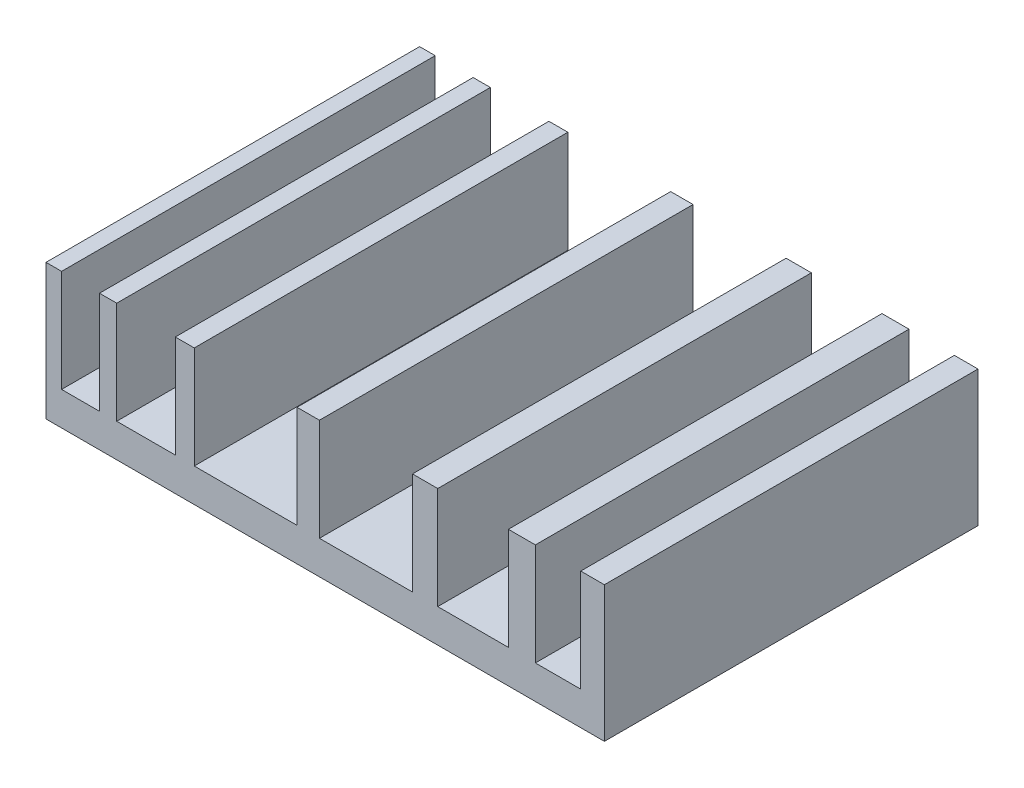
ISO-10303-21;
HEADER;
FILE_DESCRIPTION(('STEP AP214'),'2;1');
FILE_NAME('part.step','',(''),(''),'','','');
FILE_SCHEMA(('AUTOMOTIVE_DESIGN { 1 0 10303 214 1 1 1 1 }'));
ENDSEC;
DATA;
#1=APPLICATION_CONTEXT('core data for automotive mechanical design processes');
#2=APPLICATION_PROTOCOL_DEFINITION('international standard','automotive_design',2000,#1);
#3=PRODUCT_CONTEXT('',#1,'mechanical');
#4=PRODUCT('Part','Part','',(#3));
#5=PRODUCT_RELATED_PRODUCT_CATEGORY('part','',(#4));
#6=PRODUCT_DEFINITION_FORMATION('','',#4);
#7=PRODUCT_DEFINITION_CONTEXT('part definition',#1,'design');
#8=PRODUCT_DEFINITION('design','',#6,#7);
#9=PRODUCT_DEFINITION_SHAPE('','',#8);
#10=(LENGTH_UNIT() NAMED_UNIT(*) SI_UNIT(.MILLI.,.METRE.));
#11=(NAMED_UNIT(*) PLANE_ANGLE_UNIT() SI_UNIT($,.RADIAN.));
#12=(NAMED_UNIT(*) SI_UNIT($,.STERADIAN.) SOLID_ANGLE_UNIT());
#13=UNCERTAINTY_MEASURE_WITH_UNIT(LENGTH_MEASURE(1.E-05),#10,'distance_accuracy_value','');
#14=(GEOMETRIC_REPRESENTATION_CONTEXT(3) GLOBAL_UNCERTAINTY_ASSIGNED_CONTEXT((#13)) GLOBAL_UNIT_ASSIGNED_CONTEXT((#10,
#11,#12)) REPRESENTATION_CONTEXT('',''));
#15=CARTESIAN_POINT('',(0.,0.,0.));
#16=DIRECTION('',(0.,0.,1.));
#17=DIRECTION('',(1.,0.,0.));
#18=AXIS2_PLACEMENT_3D('',#15,#16,#17);
#19=CARTESIAN_POINT('',(0.,19.9,0.));
#20=DIRECTION('',(0.,-1.,0.));
#21=DIRECTION('',(0.,0.,-1.));
#22=AXIS2_PLACEMENT_3D('',#19,#20,#21);
#23=PLANE('',#22);
#24=DIRECTION('',(1.,0.,0.));
#25=VECTOR('',#24,1.);
#26=CARTESIAN_POINT('',(0.,19.9,0.));
#27=LINE('',#26,#25);
#28=CARTESIAN_POINT('',(0.,19.9,0.));
#29=VERTEX_POINT('',#28);
#30=CARTESIAN_POINT('',(2.28802288478876,19.9,0.));
#31=VERTEX_POINT('',#30);
#32=EDGE_CURVE('E391',#29,#31,#27,.T.);
#33=ORIENTED_EDGE('',*,*,#32,.T.);
#34=DIRECTION('',(0.,0.,1.));
#35=VECTOR('',#34,1.);
#36=CARTESIAN_POINT('',(2.28802288478876,19.9,-54.8));
#37=LINE('',#36,#35);
#38=CARTESIAN_POINT('',(2.28802288478876,19.9,-54.8));
#39=VERTEX_POINT('',#38);
#40=EDGE_CURVE('E349',#39,#31,#37,.T.);
#41=ORIENTED_EDGE('',*,*,#40,.F.);
#42=DIRECTION('',(-1.,0.,0.));
#43=VECTOR('',#42,1.);
#44=CARTESIAN_POINT('',(0.,19.9,-54.8));
#45=LINE('',#44,#43);
#46=CARTESIAN_POINT('',(0.,19.9,-54.8));
#47=VERTEX_POINT('',#46);
#48=EDGE_CURVE('E397',#39,#47,#45,.T.);
#49=ORIENTED_EDGE('',*,*,#48,.T.);
#50=DIRECTION('',(0.,0.,1.));
#51=VECTOR('',#50,1.);
#52=CARTESIAN_POINT('',(0.,19.9,0.));
#53=LINE('',#52,#51);
#54=EDGE_CURVE('E386',#47,#29,#53,.T.);
#55=ORIENTED_EDGE('',*,*,#54,.T.);
#56=EDGE_LOOP('',(#33,#41,#49,#55));
#57=FACE_BOUND('',#56,.T.);
#58=ADVANCED_FACE('F33',(#57),#23,.F.);
#59=CARTESIAN_POINT('',(67.819652940637,19.9,0.));
#60=VERTEX_POINT('',#59);
#61=CARTESIAN_POINT('',(71.7785046278155,19.9,0.));
#62=VERTEX_POINT('',#61);
#63=EDGE_CURVE('E475',#60,#62,#27,.T.);
#64=ORIENTED_EDGE('',*,*,#63,.T.);
#65=DIRECTION('',(0.,0.,1.));
#66=VECTOR('',#65,1.);
#67=CARTESIAN_POINT('',(71.7785046278155,19.9,-54.8));
#68=LINE('',#67,#66);
#69=CARTESIAN_POINT('',(71.7785046278155,19.9,-54.8));
#70=VERTEX_POINT('',#69);
#71=EDGE_CURVE('E324',#70,#62,#68,.T.);
#72=ORIENTED_EDGE('',*,*,#71,.F.);
#73=CARTESIAN_POINT('',(67.819652940637,19.9,-54.8));
#74=VERTEX_POINT('',#73);
#75=EDGE_CURVE('E402',#70,#74,#45,.T.);
#76=ORIENTED_EDGE('',*,*,#75,.T.);
#77=DIRECTION('',(0.,0.,-1.));
#78=VECTOR('',#77,1.);
#79=CARTESIAN_POINT('',(67.819652940637,19.9,-54.8));
#80=LINE('',#79,#78);
#81=EDGE_CURVE('E289',#60,#74,#80,.T.);
#82=ORIENTED_EDGE('',*,*,#81,.F.);
#83=EDGE_LOOP('',(#64,#72,#76,#82));
#84=FACE_BOUND('',#83,.T.);
#85=ADVANCED_FACE('F465',(#84),#23,.F.);
#86=CARTESIAN_POINT('',(53.7530948181092,19.9,0.));
#87=VERTEX_POINT('',#86);
#88=CARTESIAN_POINT('',(57.4592538444039,19.9,0.));
#89=VERTEX_POINT('',#88);
#90=EDGE_CURVE('E477',#87,#89,#27,.T.);
#91=ORIENTED_EDGE('',*,*,#90,.T.);
#92=DIRECTION('',(0.,0.,1.));
#93=VECTOR('',#92,1.);
#94=CARTESIAN_POINT('',(57.4592538444039,19.9,-54.8));
#95=LINE('',#94,#93);
#96=CARTESIAN_POINT('',(57.4592538444039,19.9,-54.8));
#97=VERTEX_POINT('',#96);
#98=EDGE_CURVE('E299',#97,#89,#95,.T.);
#99=ORIENTED_EDGE('',*,*,#98,.F.);
#100=CARTESIAN_POINT('',(53.7530948181092,19.9,-54.8));
#101=VERTEX_POINT('',#100);
#102=EDGE_CURVE('E450',#97,#101,#45,.T.);
#103=ORIENTED_EDGE('',*,*,#102,.T.);
#104=DIRECTION('',(0.,0.,-1.));
#105=VECTOR('',#104,1.);
#106=CARTESIAN_POINT('',(53.7530948181092,19.9,0.));
#107=LINE('',#106,#105);
#108=EDGE_CURVE('E263',#87,#101,#107,.T.);
#109=ORIENTED_EDGE('',*,*,#108,.F.);
#110=EDGE_LOOP('',(#91,#99,#103,#109));
#111=FACE_BOUND('',#110,.T.);
#112=ADVANCED_FACE('F501',(#111),#23,.F.);
#113=CARTESIAN_POINT('',(36.822686538899,19.9,0.));
#114=VERTEX_POINT('',#113);
#115=CARTESIAN_POINT('',(40.1076911303876,19.9,0.));
#116=VERTEX_POINT('',#115);
#117=EDGE_CURVE('E479',#114,#116,#27,.T.);
#118=ORIENTED_EDGE('',*,*,#117,.T.);
#119=DIRECTION('',(0.,0.,1.));
#120=VECTOR('',#119,1.);
#121=CARTESIAN_POINT('',(40.1076911303876,19.9,0.));
#122=LINE('',#121,#120);
#123=CARTESIAN_POINT('',(40.1076911303876,19.9,-54.8));
#124=VERTEX_POINT('',#123);
#125=EDGE_CURVE('E273',#124,#116,#122,.T.);
#126=ORIENTED_EDGE('',*,*,#125,.F.);
#127=CARTESIAN_POINT('',(36.822686538899,19.9,-54.8));
#128=VERTEX_POINT('',#127);
#129=EDGE_CURVE('E445',#124,#128,#45,.T.);
#130=ORIENTED_EDGE('',*,*,#129,.T.);
#131=DIRECTION('',(0.,0.,-1.));
#132=VECTOR('',#131,1.);
#133=CARTESIAN_POINT('',(36.822686538899,19.9,-54.8));
#134=LINE('',#133,#132);
#135=EDGE_CURVE('E239',#114,#128,#134,.T.);
#136=ORIENTED_EDGE('',*,*,#135,.F.);
#137=EDGE_LOOP('',(#118,#126,#130,#136));
#138=FACE_BOUND('',#137,.T.);
#139=ADVANCED_FACE('F518',(#138),#23,.F.);
#140=CARTESIAN_POINT('',(18.9657385031152,19.9,0.));
#141=VERTEX_POINT('',#140);
#142=CARTESIAN_POINT('',(21.7453577728362,19.9,0.));
#143=VERTEX_POINT('',#142);
#144=EDGE_CURVE('E522',#141,#143,#27,.T.);
#145=ORIENTED_EDGE('',*,*,#144,.T.);
#146=DIRECTION('',(0.,0.,1.));
#147=VECTOR('',#146,1.);
#148=CARTESIAN_POINT('',(21.7453577728362,19.9,-54.8));
#149=LINE('',#148,#147);
#150=CARTESIAN_POINT('',(21.7453577728362,19.9,-54.8));
#151=VERTEX_POINT('',#150);
#152=EDGE_CURVE('E223',#151,#143,#149,.T.);
#153=ORIENTED_EDGE('',*,*,#152,.F.);
#154=CARTESIAN_POINT('',(18.9657385031152,19.9,-54.8));
#155=VERTEX_POINT('',#154);
#156=EDGE_CURVE('E439',#151,#155,#45,.T.);
#157=ORIENTED_EDGE('',*,*,#156,.T.);
#158=DIRECTION('',(0.,0.,-1.));
#159=VECTOR('',#158,1.);
#160=CARTESIAN_POINT('',(18.9657385031152,19.9,0.));
#161=LINE('',#160,#159);
#162=EDGE_CURVE('E364',#141,#155,#161,.T.);
#163=ORIENTED_EDGE('',*,*,#162,.F.);
#164=EDGE_LOOP('',(#145,#153,#157,#163));
#165=FACE_BOUND('',#164,.T.);
#166=ADVANCED_FACE('F513',(#165),#23,.F.);
#167=CARTESIAN_POINT('',(10.3741880330682,19.9,-54.8));
#168=VERTEX_POINT('',#167);
#169=CARTESIAN_POINT('',(7.8472614242309,19.9,-54.8));
#170=VERTEX_POINT('',#169);
#171=EDGE_CURVE('E437',#168,#170,#45,.T.);
#172=ORIENTED_EDGE('',*,*,#171,.T.);
#173=DIRECTION('',(0.,0.,-1.));
#174=VECTOR('',#173,1.);
#175=CARTESIAN_POINT('',(7.8472614242309,19.9,-54.8));
#176=LINE('',#175,#174);
#177=CARTESIAN_POINT('',(7.8472614242309,19.9,0.));
#178=VERTEX_POINT('',#177);
#179=EDGE_CURVE('E339',#178,#170,#176,.T.);
#180=ORIENTED_EDGE('',*,*,#179,.F.);
#181=CARTESIAN_POINT('',(10.3741880330682,19.9,0.));
#182=VERTEX_POINT('',#181);
#183=EDGE_CURVE('E395',#178,#182,#27,.T.);
#184=ORIENTED_EDGE('',*,*,#183,.T.);
#185=DIRECTION('',(0.,0.,1.));
#186=VECTOR('',#185,1.);
#187=CARTESIAN_POINT('',(10.3741880330682,19.9,0.));
#188=LINE('',#187,#186);
#189=EDGE_CURVE('E254',#168,#182,#188,.T.);
#190=ORIENTED_EDGE('',*,*,#189,.F.);
#191=EDGE_LOOP('',(#172,#180,#184,#190));
#192=FACE_BOUND('',#191,.T.);
#193=ADVANCED_FACE('F505',(#192),#23,.F.);
#194=CARTESIAN_POINT('',(0.,19.9,0.));
#195=DIRECTION('',(1.,0.,0.));
#196=DIRECTION('',(0.,0.,-1.));
#197=AXIS2_PLACEMENT_3D('',#194,#195,#196);
#198=PLANE('',#197);
#199=DIRECTION('',(0.,0.,1.));
#200=VECTOR('',#199,1.);
#201=CARTESIAN_POINT('',(0.,0.,0.));
#202=LINE('',#201,#200);
#203=CARTESIAN_POINT('',(0.,0.,-54.8));
#204=VERTEX_POINT('',#203);
#205=CARTESIAN_POINT('',(0.,0.,0.));
#206=VERTEX_POINT('',#205);
#207=EDGE_CURVE('E378',#204,#206,#202,.T.);
#208=ORIENTED_EDGE('',*,*,#207,.T.);
#209=DIRECTION('',(0.,-1.,0.));
#210=VECTOR('',#209,1.);
#211=CARTESIAN_POINT('',(0.,19.9,0.));
#212=LINE('',#211,#210);
#213=EDGE_CURVE('E11',#29,#206,#212,.T.);
#214=ORIENTED_EDGE('',*,*,#213,.F.);
#215=ORIENTED_EDGE('',*,*,#54,.F.);
#216=DIRECTION('',(0.,-1.,0.));
#217=VECTOR('',#216,1.);
#218=CARTESIAN_POINT('',(0.,19.9,-54.8));
#219=LINE('',#218,#217);
#220=EDGE_CURVE('E401',#47,#204,#219,.T.);
#221=ORIENTED_EDGE('',*,*,#220,.T.);
#222=EDGE_LOOP('',(#208,#214,#215,#221));
#223=FACE_BOUND('',#222,.T.);
#224=ADVANCED_FACE('F35',(#223),#198,.F.);
#225=CARTESIAN_POINT('',(0.,19.9,0.));
#226=DIRECTION('',(0.,0.,-1.));
#227=DIRECTION('',(-1.,0.,0.));
#228=AXIS2_PLACEMENT_3D('',#225,#226,#227);
#229=PLANE('',#228);
#230=DIRECTION('',(1.,0.,0.));
#231=VECTOR('',#230,1.);
#232=CARTESIAN_POINT('',(2.28802288478876,4.9,0.));
#233=LINE('',#232,#231);
#234=CARTESIAN_POINT('',(2.28802288478876,4.9,0.));
#235=VERTEX_POINT('',#234);
#236=CARTESIAN_POINT('',(7.8472614242309,4.9,0.));
#237=VERTEX_POINT('',#236);
#238=EDGE_CURVE('E338',#235,#237,#233,.T.);
#239=ORIENTED_EDGE('',*,*,#238,.F.);
#240=DIRECTION('',(0.,1.,0.));
#241=VECTOR('',#240,1.);
#242=CARTESIAN_POINT('',(2.28802288478876,4.9,0.));
#243=LINE('',#242,#241);
#244=EDGE_CURVE('E348',#235,#31,#243,.T.);
#245=ORIENTED_EDGE('',*,*,#244,.T.);
#246=ORIENTED_EDGE('',*,*,#32,.F.);
#247=ORIENTED_EDGE('',*,*,#213,.T.);
#248=DIRECTION('',(1.,0.,0.));
#249=VECTOR('',#248,1.);
#250=CARTESIAN_POINT('',(0.,0.,0.));
#251=LINE('',#250,#249);
#252=CARTESIAN_POINT('',(81.9,0.,0.));
#253=VERTEX_POINT('',#252);
#254=EDGE_CURVE('E405',#206,#253,#251,.T.);
#255=ORIENTED_EDGE('',*,*,#254,.T.);
#256=DIRECTION('',(0.,-1.,0.));
#257=VECTOR('',#256,1.);
#258=CARTESIAN_POINT('',(81.9,19.9,0.));
#259=LINE('',#258,#257);
#260=CARTESIAN_POINT('',(81.9,19.9,0.));
#261=VERTEX_POINT('',#260);
#262=EDGE_CURVE('E41',#261,#253,#259,.T.);
#263=ORIENTED_EDGE('',*,*,#262,.F.);
#264=CARTESIAN_POINT('',(78.4327446977538,19.9,0.));
#265=VERTEX_POINT('',#264);
#266=EDGE_CURVE('E389',#265,#261,#27,.T.);
#267=ORIENTED_EDGE('',*,*,#266,.F.);
#268=DIRECTION('',(0.,1.,0.));
#269=VECTOR('',#268,1.);
#270=CARTESIAN_POINT('',(78.4327446977538,4.9,0.));
#271=LINE('',#270,#269);
#272=CARTESIAN_POINT('',(78.4327446977538,4.9,0.));
#273=VERTEX_POINT('',#272);
#274=EDGE_CURVE('E48',#273,#265,#271,.T.);
#275=ORIENTED_EDGE('',*,*,#274,.F.);
#276=DIRECTION('',(1.,0.,0.));
#277=VECTOR('',#276,1.);
#278=CARTESIAN_POINT('',(71.7785046278155,4.9,0.));
#279=LINE('',#278,#277);
#280=CARTESIAN_POINT('',(71.7785046278155,4.9,0.));
#281=VERTEX_POINT('',#280);
#282=EDGE_CURVE('E313',#281,#273,#279,.T.);
#283=ORIENTED_EDGE('',*,*,#282,.F.);
#284=DIRECTION('',(0.,1.,0.));
#285=VECTOR('',#284,1.);
#286=CARTESIAN_POINT('',(71.7785046278155,4.9,0.));
#287=LINE('',#286,#285);
#288=EDGE_CURVE('E323',#281,#62,#287,.T.);
#289=ORIENTED_EDGE('',*,*,#288,.T.);
#290=ORIENTED_EDGE('',*,*,#63,.F.);
#291=DIRECTION('',(0.,1.,0.));
#292=VECTOR('',#291,1.);
#293=CARTESIAN_POINT('',(67.819652940637,4.9,0.));
#294=LINE('',#293,#292);
#295=CARTESIAN_POINT('',(67.819652940637,4.9,0.));
#296=VERTEX_POINT('',#295);
#297=EDGE_CURVE('E56',#296,#60,#294,.T.);
#298=ORIENTED_EDGE('',*,*,#297,.F.);
#299=DIRECTION('',(1.,0.,0.));
#300=VECTOR('',#299,1.);
#301=CARTESIAN_POINT('',(57.4592538444039,4.9,0.));
#302=LINE('',#301,#300);
#303=CARTESIAN_POINT('',(57.4592538444039,4.9,0.));
#304=VERTEX_POINT('',#303);
#305=EDGE_CURVE('E288',#304,#296,#302,.T.);
#306=ORIENTED_EDGE('',*,*,#305,.F.);
#307=DIRECTION('',(0.,1.,0.));
#308=VECTOR('',#307,1.);
#309=CARTESIAN_POINT('',(57.4592538444039,4.9,0.));
#310=LINE('',#309,#308);
#311=EDGE_CURVE('E298',#304,#89,#310,.T.);
#312=ORIENTED_EDGE('',*,*,#311,.T.);
#313=ORIENTED_EDGE('',*,*,#90,.F.);
#314=DIRECTION('',(0.,1.,0.));
#315=VECTOR('',#314,1.);
#316=CARTESIAN_POINT('',(53.7530948181092,4.9,0.));
#317=LINE('',#316,#315);
#318=CARTESIAN_POINT('',(53.7530948181092,4.9,0.));
#319=VERTEX_POINT('',#318);
#320=EDGE_CURVE('E281',#319,#87,#317,.T.);
#321=ORIENTED_EDGE('',*,*,#320,.F.);
#322=DIRECTION('',(1.,0.,0.));
#323=VECTOR('',#322,1.);
#324=CARTESIAN_POINT('',(40.1076911303876,4.9,0.));
#325=LINE('',#324,#323);
#326=CARTESIAN_POINT('',(40.1076911303876,4.9,0.));
#327=VERTEX_POINT('',#326);
#328=EDGE_CURVE('E262',#327,#319,#325,.T.);
#329=ORIENTED_EDGE('',*,*,#328,.F.);
#330=DIRECTION('',(0.,1.,0.));
#331=VECTOR('',#330,1.);
#332=CARTESIAN_POINT('',(40.1076911303876,4.9,0.));
#333=LINE('',#332,#331);
#334=EDGE_CURVE('E272',#327,#116,#333,.T.);
#335=ORIENTED_EDGE('',*,*,#334,.T.);
#336=ORIENTED_EDGE('',*,*,#117,.F.);
#337=DIRECTION('',(0.,1.,0.));
#338=VECTOR('',#337,1.);
#339=CARTESIAN_POINT('',(36.822686538899,4.9,0.));
#340=LINE('',#339,#338);
#341=CARTESIAN_POINT('',(36.822686538899,4.9,0.));
#342=VERTEX_POINT('',#341);
#343=EDGE_CURVE('E228',#342,#114,#340,.T.);
#344=ORIENTED_EDGE('',*,*,#343,.F.);
#345=DIRECTION('',(1.,0.,0.));
#346=VECTOR('',#345,1.);
#347=CARTESIAN_POINT('',(21.7453577728362,4.9,0.));
#348=LINE('',#347,#346);
#349=CARTESIAN_POINT('',(21.7453577728362,4.9,0.));
#350=VERTEX_POINT('',#349);
#351=EDGE_CURVE('E235',#350,#342,#348,.T.);
#352=ORIENTED_EDGE('',*,*,#351,.F.);
#353=DIRECTION('',(0.,1.,0.));
#354=VECTOR('',#353,1.);
#355=CARTESIAN_POINT('',(21.7453577728362,4.9,0.));
#356=LINE('',#355,#354);
#357=EDGE_CURVE('E217',#350,#143,#356,.T.);
#358=ORIENTED_EDGE('',*,*,#357,.T.);
#359=ORIENTED_EDGE('',*,*,#144,.F.);
#360=DIRECTION('',(0.,1.,0.));
#361=VECTOR('',#360,1.);
#362=CARTESIAN_POINT('',(18.9657385031152,4.9,0.));
#363=LINE('',#362,#361);
#364=CARTESIAN_POINT('',(18.9657385031152,4.9,0.));
#365=VERTEX_POINT('',#364);
#366=EDGE_CURVE('E382',#365,#141,#363,.T.);
#367=ORIENTED_EDGE('',*,*,#366,.F.);
#368=DIRECTION('',(1.,0.,0.));
#369=VECTOR('',#368,1.);
#370=CARTESIAN_POINT('',(10.3741880330682,4.9,0.));
#371=LINE('',#370,#369);
#372=CARTESIAN_POINT('',(10.3741880330682,4.9,0.));
#373=VERTEX_POINT('',#372);
#374=EDGE_CURVE('E363',#373,#365,#371,.T.);
#375=ORIENTED_EDGE('',*,*,#374,.F.);
#376=DIRECTION('',(0.,1.,0.));
#377=VECTOR('',#376,1.);
#378=CARTESIAN_POINT('',(10.3741880330682,4.9,0.));
#379=LINE('',#378,#377);
#380=EDGE_CURVE('E373',#373,#182,#379,.T.);
#381=ORIENTED_EDGE('',*,*,#380,.T.);
#382=ORIENTED_EDGE('',*,*,#183,.F.);
#383=DIRECTION('',(0.,1.,0.));
#384=VECTOR('',#383,1.);
#385=CARTESIAN_POINT('',(7.8472614242309,4.9,0.));
#386=LINE('',#385,#384);
#387=EDGE_CURVE('E356',#237,#178,#386,.T.);
#388=ORIENTED_EDGE('',*,*,#387,.F.);
#389=EDGE_LOOP('',(#239,#245,#246,#247,#255,#263,#267,#275,#283,#289,#290,#298,#306,#312,#313,
#321,#329,#335,#336,#344,#352,#358,#359,#367,#375,#381,#382,#388));
#390=FACE_BOUND('',#389,.T.);
#391=ADVANCED_FACE('F242',(#390),#229,.F.);
#392=CARTESIAN_POINT('',(81.9,19.9,0.));
#393=DIRECTION('',(-1.,0.,0.));
#394=DIRECTION('',(0.,0.,1.));
#395=AXIS2_PLACEMENT_3D('',#392,#393,#394);
#396=PLANE('',#395);
#397=DIRECTION('',(0.,0.,-1.));
#398=VECTOR('',#397,1.);
#399=CARTESIAN_POINT('',(81.9,0.,0.));
#400=LINE('',#399,#398);
#401=CARTESIAN_POINT('',(81.9,0.,-54.8));
#402=VERTEX_POINT('',#401);
#403=EDGE_CURVE('E407',#253,#402,#400,.T.);
#404=ORIENTED_EDGE('',*,*,#403,.T.);
#405=DIRECTION('',(0.,-1.,0.));
#406=VECTOR('',#405,1.);
#407=CARTESIAN_POINT('',(81.9,19.9,-54.8));
#408=LINE('',#407,#406);
#409=CARTESIAN_POINT('',(81.9,19.9,-54.8));
#410=VERTEX_POINT('',#409);
#411=EDGE_CURVE('E412',#410,#402,#408,.T.);
#412=ORIENTED_EDGE('',*,*,#411,.F.);
#413=DIRECTION('',(0.,0.,-1.));
#414=VECTOR('',#413,1.);
#415=CARTESIAN_POINT('',(81.9,19.9,0.));
#416=LINE('',#415,#414);
#417=EDGE_CURVE('E394',#261,#410,#416,.T.);
#418=ORIENTED_EDGE('',*,*,#417,.F.);
#419=ORIENTED_EDGE('',*,*,#262,.T.);
#420=EDGE_LOOP('',(#404,#412,#418,#419));
#421=FACE_BOUND('',#420,.T.);
#422=ADVANCED_FACE('F419',(#421),#396,.F.);
#423=CARTESIAN_POINT('',(0.,19.9,-54.8));
#424=DIRECTION('',(0.,0.,1.));
#425=DIRECTION('',(1.,0.,0.));
#426=AXIS2_PLACEMENT_3D('',#423,#424,#425);
#427=PLANE('',#426);
#428=ORIENTED_EDGE('',*,*,#48,.F.);
#429=DIRECTION('',(0.,1.,0.));
#430=VECTOR('',#429,1.);
#431=CARTESIAN_POINT('',(2.28802288478876,4.9,-54.8));
#432=LINE('',#431,#430);
#433=CARTESIAN_POINT('',(2.28802288478876,4.9,-54.8));
#434=VERTEX_POINT('',#433);
#435=EDGE_CURVE('E326',#434,#39,#432,.T.);
#436=ORIENTED_EDGE('',*,*,#435,.F.);
#437=DIRECTION('',(-1.,0.,0.));
#438=VECTOR('',#437,1.);
#439=CARTESIAN_POINT('',(2.28802288478876,4.9,-54.8));
#440=LINE('',#439,#438);
#441=CARTESIAN_POINT('',(7.8472614242309,4.9,-54.8));
#442=VERTEX_POINT('',#441);
#443=EDGE_CURVE('E345',#442,#434,#440,.T.);
#444=ORIENTED_EDGE('',*,*,#443,.F.);
#445=DIRECTION('',(0.,1.,0.));
#446=VECTOR('',#445,1.);
#447=CARTESIAN_POINT('',(7.8472614242309,4.9,-54.8));
#448=LINE('',#447,#446);
#449=EDGE_CURVE('E353',#442,#170,#448,.T.);
#450=ORIENTED_EDGE('',*,*,#449,.T.);
#451=ORIENTED_EDGE('',*,*,#171,.F.);
#452=DIRECTION('',(0.,1.,0.));
#453=VECTOR('',#452,1.);
#454=CARTESIAN_POINT('',(10.3741880330682,4.9,-54.8));
#455=LINE('',#454,#453);
#456=CARTESIAN_POINT('',(10.3741880330682,4.9,-54.8));
#457=VERTEX_POINT('',#456);
#458=EDGE_CURVE('E376',#457,#168,#455,.T.);
#459=ORIENTED_EDGE('',*,*,#458,.F.);
#460=DIRECTION('',(-1.,0.,0.));
#461=VECTOR('',#460,1.);
#462=CARTESIAN_POINT('',(10.3741880330682,4.9,-54.8));
#463=LINE('',#462,#461);
#464=CARTESIAN_POINT('',(18.9657385031152,4.9,-54.8));
#465=VERTEX_POINT('',#464);
#466=EDGE_CURVE('E370',#465,#457,#463,.T.);
#467=ORIENTED_EDGE('',*,*,#466,.F.);
#468=DIRECTION('',(0.,1.,0.));
#469=VECTOR('',#468,1.);
#470=CARTESIAN_POINT('',(18.9657385031152,4.9,-54.8));
#471=LINE('',#470,#469);
#472=EDGE_CURVE('E379',#465,#155,#471,.T.);
#473=ORIENTED_EDGE('',*,*,#472,.T.);
#474=ORIENTED_EDGE('',*,*,#156,.F.);
#475=DIRECTION('',(0.,1.,0.));
#476=VECTOR('',#475,1.);
#477=CARTESIAN_POINT('',(21.7453577728362,4.9,-54.8));
#478=LINE('',#477,#476);
#479=CARTESIAN_POINT('',(21.7453577728362,4.9,-54.8));
#480=VERTEX_POINT('',#479);
#481=EDGE_CURVE('E252',#480,#151,#478,.T.);
#482=ORIENTED_EDGE('',*,*,#481,.F.);
#483=DIRECTION('',(-1.,0.,0.));
#484=VECTOR('',#483,1.);
#485=CARTESIAN_POINT('',(21.7453577728362,4.9,-54.8));
#486=LINE('',#485,#484);
#487=CARTESIAN_POINT('',(36.822686538899,4.9,-54.8));
#488=VERTEX_POINT('',#487);
#489=EDGE_CURVE('E229',#488,#480,#486,.T.);
#490=ORIENTED_EDGE('',*,*,#489,.F.);
#491=DIRECTION('',(0.,1.,0.));
#492=VECTOR('',#491,1.);
#493=CARTESIAN_POINT('',(36.822686538899,4.9,-54.8));
#494=LINE('',#493,#492);
#495=EDGE_CURVE('E255',#488,#128,#494,.T.);
#496=ORIENTED_EDGE('',*,*,#495,.T.);
#497=ORIENTED_EDGE('',*,*,#129,.F.);
#498=DIRECTION('',(0.,1.,0.));
#499=VECTOR('',#498,1.);
#500=CARTESIAN_POINT('',(40.1076911303876,4.9,-54.8));
#501=LINE('',#500,#499);
#502=CARTESIAN_POINT('',(40.1076911303876,4.9,-54.8));
#503=VERTEX_POINT('',#502);
#504=EDGE_CURVE('E250',#503,#124,#501,.T.);
#505=ORIENTED_EDGE('',*,*,#504,.F.);
#506=DIRECTION('',(-1.,0.,0.));
#507=VECTOR('',#506,1.);
#508=CARTESIAN_POINT('',(40.1076911303876,4.9,-54.8));
#509=LINE('',#508,#507);
#510=CARTESIAN_POINT('',(53.7530948181092,4.9,-54.8));
#511=VERTEX_POINT('',#510);
#512=EDGE_CURVE('E269',#511,#503,#509,.T.);
#513=ORIENTED_EDGE('',*,*,#512,.F.);
#514=DIRECTION('',(0.,1.,0.));
#515=VECTOR('',#514,1.);
#516=CARTESIAN_POINT('',(53.7530948181092,4.9,-54.8));
#517=LINE('',#516,#515);
#518=EDGE_CURVE('E278',#511,#101,#517,.T.);
#519=ORIENTED_EDGE('',*,*,#518,.T.);
#520=ORIENTED_EDGE('',*,*,#102,.F.);
#521=DIRECTION('',(0.,1.,0.));
#522=VECTOR('',#521,1.);
#523=CARTESIAN_POINT('',(57.4592538444039,4.9,-54.8));
#524=LINE('',#523,#522);
#525=CARTESIAN_POINT('',(57.4592538444039,4.9,-54.8));
#526=VERTEX_POINT('',#525);
#527=EDGE_CURVE('E275',#526,#97,#524,.T.);
#528=ORIENTED_EDGE('',*,*,#527,.F.);
#529=DIRECTION('',(-1.,0.,0.));
#530=VECTOR('',#529,1.);
#531=CARTESIAN_POINT('',(57.4592538444039,4.9,-54.8));
#532=LINE('',#531,#530);
#533=CARTESIAN_POINT('',(67.819652940637,4.9,-54.8));
#534=VERTEX_POINT('',#533);
#535=EDGE_CURVE('E295',#534,#526,#532,.T.);
#536=ORIENTED_EDGE('',*,*,#535,.F.);
#537=DIRECTION('',(0.,1.,0.));
#538=VECTOR('',#537,1.);
#539=CARTESIAN_POINT('',(67.819652940637,4.9,-54.8));
#540=LINE('',#539,#538);
#541=EDGE_CURVE('E304',#534,#74,#540,.T.);
#542=ORIENTED_EDGE('',*,*,#541,.T.);
#543=ORIENTED_EDGE('',*,*,#75,.F.);
#544=DIRECTION('',(0.,1.,0.));
#545=VECTOR('',#544,1.);
#546=CARTESIAN_POINT('',(71.7785046278155,4.9,-54.8));
#547=LINE('',#546,#545);
#548=CARTESIAN_POINT('',(71.7785046278155,4.9,-54.8));
#549=VERTEX_POINT('',#548);
#550=EDGE_CURVE('E301',#549,#70,#547,.T.);
#551=ORIENTED_EDGE('',*,*,#550,.F.);
#552=DIRECTION('',(-1.,0.,0.));
#553=VECTOR('',#552,1.);
#554=CARTESIAN_POINT('',(71.7785046278155,4.9,-54.8));
#555=LINE('',#554,#553);
#556=CARTESIAN_POINT('',(78.4327446977538,4.9,-54.8));
#557=VERTEX_POINT('',#556);
#558=EDGE_CURVE('E320',#557,#549,#555,.T.);
#559=ORIENTED_EDGE('',*,*,#558,.F.);
#560=DIRECTION('',(0.,1.,0.));
#561=VECTOR('',#560,1.);
#562=CARTESIAN_POINT('',(78.4327446977538,4.9,-54.8));
#563=LINE('',#562,#561);
#564=CARTESIAN_POINT('',(78.4327446977538,19.9,-54.8));
#565=VERTEX_POINT('',#564);
#566=EDGE_CURVE('E329',#557,#565,#563,.T.);
#567=ORIENTED_EDGE('',*,*,#566,.T.);
#568=EDGE_CURVE('E398',#410,#565,#45,.T.);
#569=ORIENTED_EDGE('',*,*,#568,.F.);
#570=ORIENTED_EDGE('',*,*,#411,.T.);
#571=DIRECTION('',(-1.,0.,0.));
#572=VECTOR('',#571,1.);
#573=CARTESIAN_POINT('',(0.,0.,-54.8));
#574=LINE('',#573,#572);
#575=EDGE_CURVE('E390',#402,#204,#574,.T.);
#576=ORIENTED_EDGE('',*,*,#575,.T.);
#577=ORIENTED_EDGE('',*,*,#220,.F.);
#578=EDGE_LOOP('',(#428,#436,#444,#450,#451,#459,#467,#473,#474,#482,#490,#496,#497,#505,#513,
#519,#520,#528,#536,#542,#543,#551,#559,#567,#569,#570,#576,#577));
#579=FACE_BOUND('',#578,.T.);
#580=ADVANCED_FACE('F429',(#579),#427,.F.);
#581=ORIENTED_EDGE('',*,*,#568,.T.);
#582=DIRECTION('',(0.,0.,-1.));
#583=VECTOR('',#582,1.);
#584=CARTESIAN_POINT('',(78.4327446977538,19.9,-54.8));
#585=LINE('',#584,#583);
#586=EDGE_CURVE('E314',#265,#565,#585,.T.);
#587=ORIENTED_EDGE('',*,*,#586,.F.);
#588=ORIENTED_EDGE('',*,*,#266,.T.);
#589=ORIENTED_EDGE('',*,*,#417,.T.);
#590=EDGE_LOOP('',(#581,#587,#588,#589));
#591=FACE_BOUND('',#590,.T.);
#592=ADVANCED_FACE('F481',(#591),#23,.F.);
#593=CARTESIAN_POINT('',(0.,0.,0.));
#594=DIRECTION('',(0.,-1.,0.));
#595=DIRECTION('',(0.,0.,-1.));
#596=AXIS2_PLACEMENT_3D('',#593,#594,#595);
#597=PLANE('',#596);
#598=ORIENTED_EDGE('',*,*,#207,.F.);
#599=ORIENTED_EDGE('',*,*,#575,.F.);
#600=ORIENTED_EDGE('',*,*,#403,.F.);
#601=ORIENTED_EDGE('',*,*,#254,.F.);
#602=EDGE_LOOP('',(#598,#599,#600,#601));
#603=FACE_BOUND('',#602,.T.);
#604=ADVANCED_FACE('F425',(#603),#597,.T.);
#605=CARTESIAN_POINT('',(10.3741880330682,4.9,0.));
#606=DIRECTION('',(-1.,0.,0.));
#607=DIRECTION('',(0.,0.,1.));
#608=AXIS2_PLACEMENT_3D('',#605,#606,#607);
#609=PLANE('',#608);
#610=ORIENTED_EDGE('',*,*,#189,.T.);
#611=ORIENTED_EDGE('',*,*,#380,.F.);
#612=DIRECTION('',(0.,0.,1.));
#613=VECTOR('',#612,1.);
#614=CARTESIAN_POINT('',(10.3741880330682,4.9,0.));
#615=LINE('',#614,#613);
#616=EDGE_CURVE('E360',#457,#373,#615,.T.);
#617=ORIENTED_EDGE('',*,*,#616,.F.);
#618=ORIENTED_EDGE('',*,*,#458,.T.);
#619=EDGE_LOOP('',(#610,#611,#617,#618));
#620=FACE_BOUND('',#619,.T.);
#621=ADVANCED_FACE('F510',(#620),#609,.F.);
#622=CARTESIAN_POINT('',(18.9657385031152,4.9,0.));
#623=DIRECTION('',(1.,0.,0.));
#624=DIRECTION('',(0.,0.,-1.));
#625=AXIS2_PLACEMENT_3D('',#622,#623,#624);
#626=PLANE('',#625);
#627=ORIENTED_EDGE('',*,*,#162,.T.);
#628=ORIENTED_EDGE('',*,*,#472,.F.);
#629=DIRECTION('',(0.,0.,-1.));
#630=VECTOR('',#629,1.);
#631=CARTESIAN_POINT('',(18.9657385031152,4.9,0.));
#632=LINE('',#631,#630);
#633=EDGE_CURVE('E367',#365,#465,#632,.T.);
#634=ORIENTED_EDGE('',*,*,#633,.F.);
#635=ORIENTED_EDGE('',*,*,#366,.T.);
#636=EDGE_LOOP('',(#627,#628,#634,#635));
#637=FACE_BOUND('',#636,.T.);
#638=ADVANCED_FACE('F577',(#637),#626,.F.);
#639=CARTESIAN_POINT('',(0.,4.9,0.));
#640=DIRECTION('',(0.,-1.,0.));
#641=DIRECTION('',(0.,0.,-1.));
#642=AXIS2_PLACEMENT_3D('',#639,#640,#641);
#643=PLANE('',#642);
#644=ORIENTED_EDGE('',*,*,#616,.T.);
#645=ORIENTED_EDGE('',*,*,#374,.T.);
#646=ORIENTED_EDGE('',*,*,#633,.T.);
#647=ORIENTED_EDGE('',*,*,#466,.T.);
#648=EDGE_LOOP('',(#644,#645,#646,#647));
#649=FACE_BOUND('',#648,.T.);
#650=ADVANCED_FACE('F543',(#649),#643,.F.);
#651=CARTESIAN_POINT('',(21.7453577728362,4.9,-54.8));
#652=DIRECTION('',(-1.,0.,0.));
#653=DIRECTION('',(0.,0.,1.));
#654=AXIS2_PLACEMENT_3D('',#651,#652,#653);
#655=PLANE('',#654);
#656=ORIENTED_EDGE('',*,*,#152,.T.);
#657=ORIENTED_EDGE('',*,*,#357,.F.);
#658=DIRECTION('',(0.,0.,1.));
#659=VECTOR('',#658,1.);
#660=CARTESIAN_POINT('',(21.7453577728362,4.9,-54.8));
#661=LINE('',#660,#659);
#662=EDGE_CURVE('E220',#480,#350,#661,.T.);
#663=ORIENTED_EDGE('',*,*,#662,.F.);
#664=ORIENTED_EDGE('',*,*,#481,.T.);
#665=EDGE_LOOP('',(#656,#657,#663,#664));
#666=FACE_BOUND('',#665,.T.);
#667=ADVANCED_FACE('F219',(#666),#655,.F.);
#668=CARTESIAN_POINT('',(36.822686538899,4.9,-54.8));
#669=DIRECTION('',(1.,0.,0.));
#670=DIRECTION('',(0.,0.,-1.));
#671=AXIS2_PLACEMENT_3D('',#668,#669,#670);
#672=PLANE('',#671);
#673=ORIENTED_EDGE('',*,*,#135,.T.);
#674=ORIENTED_EDGE('',*,*,#495,.F.);
#675=DIRECTION('',(0.,0.,-1.));
#676=VECTOR('',#675,1.);
#677=CARTESIAN_POINT('',(36.822686538899,4.9,-54.8));
#678=LINE('',#677,#676);
#679=EDGE_CURVE('E244',#342,#488,#678,.T.);
#680=ORIENTED_EDGE('',*,*,#679,.F.);
#681=ORIENTED_EDGE('',*,*,#343,.T.);
#682=EDGE_LOOP('',(#673,#674,#680,#681));
#683=FACE_BOUND('',#682,.T.);
#684=ADVANCED_FACE('F535',(#683),#672,.F.);
#685=CARTESIAN_POINT('',(0.,4.9,0.));
#686=DIRECTION('',(0.,1.,0.));
#687=DIRECTION('',(0.,0.,1.));
#688=AXIS2_PLACEMENT_3D('',#685,#686,#687);
#689=PLANE('',#688);
#690=ORIENTED_EDGE('',*,*,#662,.T.);
#691=ORIENTED_EDGE('',*,*,#351,.T.);
#692=ORIENTED_EDGE('',*,*,#679,.T.);
#693=ORIENTED_EDGE('',*,*,#489,.T.);
#694=EDGE_LOOP('',(#690,#691,#692,#693));
#695=FACE_BOUND('',#694,.T.);
#696=ADVANCED_FACE('F233',(#695),#689,.T.);
#697=CARTESIAN_POINT('',(40.1076911303876,4.9,0.));
#698=DIRECTION('',(-1.,0.,0.));
#699=DIRECTION('',(0.,0.,1.));
#700=AXIS2_PLACEMENT_3D('',#697,#698,#699);
#701=PLANE('',#700);
#702=ORIENTED_EDGE('',*,*,#125,.T.);
#703=ORIENTED_EDGE('',*,*,#334,.F.);
#704=DIRECTION('',(0.,0.,1.));
#705=VECTOR('',#704,1.);
#706=CARTESIAN_POINT('',(40.1076911303876,4.9,0.));
#707=LINE('',#706,#705);
#708=EDGE_CURVE('E259',#503,#327,#707,.T.);
#709=ORIENTED_EDGE('',*,*,#708,.F.);
#710=ORIENTED_EDGE('',*,*,#504,.T.);
#711=EDGE_LOOP('',(#702,#703,#709,#710));
#712=FACE_BOUND('',#711,.T.);
#713=ADVANCED_FACE('F529',(#712),#701,.F.);
#714=CARTESIAN_POINT('',(53.7530948181092,4.9,0.));
#715=DIRECTION('',(1.,0.,0.));
#716=DIRECTION('',(0.,0.,-1.));
#717=AXIS2_PLACEMENT_3D('',#714,#715,#716);
#718=PLANE('',#717);
#719=ORIENTED_EDGE('',*,*,#108,.T.);
#720=ORIENTED_EDGE('',*,*,#518,.F.);
#721=DIRECTION('',(0.,0.,-1.));
#722=VECTOR('',#721,1.);
#723=CARTESIAN_POINT('',(53.7530948181092,4.9,0.));
#724=LINE('',#723,#722);
#725=EDGE_CURVE('E266',#319,#511,#724,.T.);
#726=ORIENTED_EDGE('',*,*,#725,.F.);
#727=ORIENTED_EDGE('',*,*,#320,.T.);
#728=EDGE_LOOP('',(#719,#720,#726,#727));
#729=FACE_BOUND('',#728,.T.);
#730=ADVANCED_FACE('F549',(#729),#718,.F.);
#731=CARTESIAN_POINT('',(0.,4.9,0.));
#732=DIRECTION('',(0.,-1.,0.));
#733=DIRECTION('',(0.,0.,-1.));
#734=AXIS2_PLACEMENT_3D('',#731,#732,#733);
#735=PLANE('',#734);
#736=ORIENTED_EDGE('',*,*,#708,.T.);
#737=ORIENTED_EDGE('',*,*,#328,.T.);
#738=ORIENTED_EDGE('',*,*,#725,.T.);
#739=ORIENTED_EDGE('',*,*,#512,.T.);
#740=EDGE_LOOP('',(#736,#737,#738,#739));
#741=FACE_BOUND('',#740,.T.);
#742=ADVANCED_FACE('F531',(#741),#735,.F.);
#743=CARTESIAN_POINT('',(57.4592538444039,4.9,-54.8));
#744=DIRECTION('',(-1.,0.,0.));
#745=DIRECTION('',(0.,0.,1.));
#746=AXIS2_PLACEMENT_3D('',#743,#744,#745);
#747=PLANE('',#746);
#748=ORIENTED_EDGE('',*,*,#98,.T.);
#749=ORIENTED_EDGE('',*,*,#311,.F.);
#750=DIRECTION('',(0.,0.,1.));
#751=VECTOR('',#750,1.);
#752=CARTESIAN_POINT('',(57.4592538444039,4.9,-54.8));
#753=LINE('',#752,#751);
#754=EDGE_CURVE('E285',#526,#304,#753,.T.);
#755=ORIENTED_EDGE('',*,*,#754,.F.);
#756=ORIENTED_EDGE('',*,*,#527,.T.);
#757=EDGE_LOOP('',(#748,#749,#755,#756));
#758=FACE_BOUND('',#757,.T.);
#759=ADVANCED_FACE('F548',(#758),#747,.F.);
#760=CARTESIAN_POINT('',(67.819652940637,4.9,-54.8));
#761=DIRECTION('',(1.,0.,0.));
#762=DIRECTION('',(0.,0.,-1.));
#763=AXIS2_PLACEMENT_3D('',#760,#761,#762);
#764=PLANE('',#763);
#765=ORIENTED_EDGE('',*,*,#81,.T.);
#766=ORIENTED_EDGE('',*,*,#541,.F.);
#767=DIRECTION('',(0.,0.,-1.));
#768=VECTOR('',#767,1.);
#769=CARTESIAN_POINT('',(67.819652940637,4.9,-54.8));
#770=LINE('',#769,#768);
#771=EDGE_CURVE('E292',#296,#534,#770,.T.);
#772=ORIENTED_EDGE('',*,*,#771,.F.);
#773=ORIENTED_EDGE('',*,*,#297,.T.);
#774=EDGE_LOOP('',(#765,#766,#772,#773));
#775=FACE_BOUND('',#774,.T.);
#776=ADVANCED_FACE('F471',(#775),#764,.F.);
#777=CARTESIAN_POINT('',(0.,4.9,0.));
#778=DIRECTION('',(0.,1.,0.));
#779=DIRECTION('',(0.,0.,1.));
#780=AXIS2_PLACEMENT_3D('',#777,#778,#779);
#781=PLANE('',#780);
#782=ORIENTED_EDGE('',*,*,#754,.T.);
#783=ORIENTED_EDGE('',*,*,#305,.T.);
#784=ORIENTED_EDGE('',*,*,#771,.T.);
#785=ORIENTED_EDGE('',*,*,#535,.T.);
#786=EDGE_LOOP('',(#782,#783,#784,#785));
#787=FACE_BOUND('',#786,.T.);
#788=ADVANCED_FACE('F473',(#787),#781,.T.);
#789=CARTESIAN_POINT('',(71.7785046278155,4.9,-54.8));
#790=DIRECTION('',(-1.,0.,0.));
#791=DIRECTION('',(0.,0.,1.));
#792=AXIS2_PLACEMENT_3D('',#789,#790,#791);
#793=PLANE('',#792);
#794=ORIENTED_EDGE('',*,*,#71,.T.);
#795=ORIENTED_EDGE('',*,*,#288,.F.);
#796=DIRECTION('',(0.,0.,1.));
#797=VECTOR('',#796,1.);
#798=CARTESIAN_POINT('',(71.7785046278155,4.9,-54.8));
#799=LINE('',#798,#797);
#800=EDGE_CURVE('E310',#549,#281,#799,.T.);
#801=ORIENTED_EDGE('',*,*,#800,.F.);
#802=ORIENTED_EDGE('',*,*,#550,.T.);
#803=EDGE_LOOP('',(#794,#795,#801,#802));
#804=FACE_BOUND('',#803,.T.);
#805=ADVANCED_FACE('F485',(#804),#793,.F.);
#806=CARTESIAN_POINT('',(78.4327446977538,4.9,-54.8));
#807=DIRECTION('',(1.,0.,0.));
#808=DIRECTION('',(0.,0.,-1.));
#809=AXIS2_PLACEMENT_3D('',#806,#807,#808);
#810=PLANE('',#809);
#811=ORIENTED_EDGE('',*,*,#586,.T.);
#812=ORIENTED_EDGE('',*,*,#566,.F.);
#813=DIRECTION('',(0.,0.,-1.));
#814=VECTOR('',#813,1.);
#815=CARTESIAN_POINT('',(78.4327446977538,4.9,-54.8));
#816=LINE('',#815,#814);
#817=EDGE_CURVE('E317',#273,#557,#816,.T.);
#818=ORIENTED_EDGE('',*,*,#817,.F.);
#819=ORIENTED_EDGE('',*,*,#274,.T.);
#820=EDGE_LOOP('',(#811,#812,#818,#819));
#821=FACE_BOUND('',#820,.T.);
#822=ADVANCED_FACE('F487',(#821),#810,.F.);
#823=CARTESIAN_POINT('',(0.,4.9,0.));
#824=DIRECTION('',(0.,1.,0.));
#825=DIRECTION('',(0.,0.,1.));
#826=AXIS2_PLACEMENT_3D('',#823,#824,#825);
#827=PLANE('',#826);
#828=ORIENTED_EDGE('',*,*,#800,.T.);
#829=ORIENTED_EDGE('',*,*,#282,.T.);
#830=ORIENTED_EDGE('',*,*,#817,.T.);
#831=ORIENTED_EDGE('',*,*,#558,.T.);
#832=EDGE_LOOP('',(#828,#829,#830,#831));
#833=FACE_BOUND('',#832,.T.);
#834=ADVANCED_FACE('F483',(#833),#827,.T.);
#835=CARTESIAN_POINT('',(2.28802288478876,4.9,-54.8));
#836=DIRECTION('',(-1.,0.,0.));
#837=DIRECTION('',(0.,0.,1.));
#838=AXIS2_PLACEMENT_3D('',#835,#836,#837);
#839=PLANE('',#838);
#840=ORIENTED_EDGE('',*,*,#40,.T.);
#841=ORIENTED_EDGE('',*,*,#244,.F.);
#842=DIRECTION('',(0.,0.,1.));
#843=VECTOR('',#842,1.);
#844=CARTESIAN_POINT('',(2.28802288478876,4.9,-54.8));
#845=LINE('',#844,#843);
#846=EDGE_CURVE('E335',#434,#235,#845,.T.);
#847=ORIENTED_EDGE('',*,*,#846,.F.);
#848=ORIENTED_EDGE('',*,*,#435,.T.);
#849=EDGE_LOOP('',(#840,#841,#847,#848));
#850=FACE_BOUND('',#849,.T.);
#851=ADVANCED_FACE('F561',(#850),#839,.F.);
#852=CARTESIAN_POINT('',(7.8472614242309,4.9,-54.8));
#853=DIRECTION('',(1.,0.,0.));
#854=DIRECTION('',(0.,0.,-1.));
#855=AXIS2_PLACEMENT_3D('',#852,#853,#854);
#856=PLANE('',#855);
#857=ORIENTED_EDGE('',*,*,#179,.T.);
#858=ORIENTED_EDGE('',*,*,#449,.F.);
#859=DIRECTION('',(0.,0.,-1.));
#860=VECTOR('',#859,1.);
#861=CARTESIAN_POINT('',(7.8472614242309,4.9,-54.8));
#862=LINE('',#861,#860);
#863=EDGE_CURVE('E342',#237,#442,#862,.T.);
#864=ORIENTED_EDGE('',*,*,#863,.F.);
#865=ORIENTED_EDGE('',*,*,#387,.T.);
#866=EDGE_LOOP('',(#857,#858,#864,#865));
#867=FACE_BOUND('',#866,.T.);
#868=ADVANCED_FACE('F565',(#867),#856,.F.);
#869=CARTESIAN_POINT('',(0.,4.9,0.));
#870=DIRECTION('',(0.,1.,0.));
#871=DIRECTION('',(0.,0.,1.));
#872=AXIS2_PLACEMENT_3D('',#869,#870,#871);
#873=PLANE('',#872);
#874=ORIENTED_EDGE('',*,*,#846,.T.);
#875=ORIENTED_EDGE('',*,*,#238,.T.);
#876=ORIENTED_EDGE('',*,*,#863,.T.);
#877=ORIENTED_EDGE('',*,*,#443,.T.);
#878=EDGE_LOOP('',(#874,#875,#876,#877));
#879=FACE_BOUND('',#878,.T.);
#880=ADVANCED_FACE('F571',(#879),#873,.T.);
#881=CLOSED_SHELL('',(#58,#85,#112,#139,#166,#193,#224,#391,#422,#580,#592,#604,#621,#638,#650,
#667,#684,#696,#713,#730,#742,#759,#776,#788,#805,#822,#834,#851,#868,#880));
#882=MANIFOLD_SOLID_BREP('B2',#881);
#883=ADVANCED_BREP_SHAPE_REPRESENTATION('',(#18,#882),#14);
#884=SHAPE_DEFINITION_REPRESENTATION(#9,#883);
ENDSEC;
END-ISO-10303-21;
